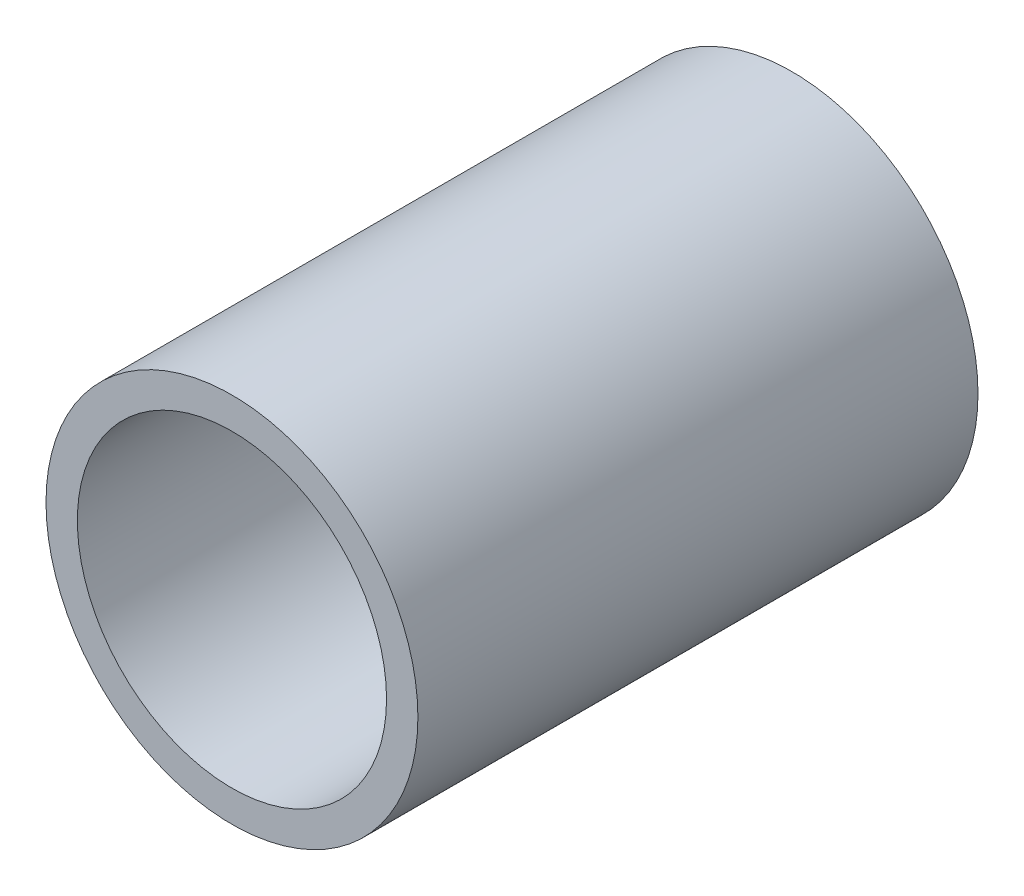
ISO-10303-21;
HEADER;
FILE_DESCRIPTION(('STEP AP214'),'2;1');
FILE_NAME('part.step','',(''),(''),'','','');
FILE_SCHEMA(('AUTOMOTIVE_DESIGN { 1 0 10303 214 1 1 1 1 }'));
ENDSEC;
DATA;
#1=APPLICATION_CONTEXT('core data for automotive mechanical design processes');
#2=APPLICATION_PROTOCOL_DEFINITION('international standard','automotive_design',2000,#1);
#3=PRODUCT_CONTEXT('',#1,'mechanical');
#4=PRODUCT('Part','Part','',(#3));
#5=PRODUCT_RELATED_PRODUCT_CATEGORY('part','',(#4));
#6=PRODUCT_DEFINITION_FORMATION('','',#4);
#7=PRODUCT_DEFINITION_CONTEXT('part definition',#1,'design');
#8=PRODUCT_DEFINITION('design','',#6,#7);
#9=PRODUCT_DEFINITION_SHAPE('','',#8);
#10=(LENGTH_UNIT() NAMED_UNIT(*) SI_UNIT(.MILLI.,.METRE.));
#11=(NAMED_UNIT(*) PLANE_ANGLE_UNIT() SI_UNIT($,.RADIAN.));
#12=(NAMED_UNIT(*) SI_UNIT($,.STERADIAN.) SOLID_ANGLE_UNIT());
#13=UNCERTAINTY_MEASURE_WITH_UNIT(LENGTH_MEASURE(1.E-05),#10,'distance_accuracy_value','');
#14=(GEOMETRIC_REPRESENTATION_CONTEXT(3) GLOBAL_UNCERTAINTY_ASSIGNED_CONTEXT((#13)) GLOBAL_UNIT_ASSIGNED_CONTEXT((#10,
#11,#12)) REPRESENTATION_CONTEXT('',''));
#15=CARTESIAN_POINT('',(0.,0.,0.));
#16=DIRECTION('',(0.,0.,1.));
#17=DIRECTION('',(1.,0.,0.));
#18=AXIS2_PLACEMENT_3D('',#15,#16,#17);
#19=CARTESIAN_POINT('',(574.675,28.5749999999999,63.5));
#20=DIRECTION('',(0.,0.,1.));
#21=DIRECTION('',(1.,0.,0.));
#22=AXIS2_PLACEMENT_3D('',#19,#20,#21);
#23=CYLINDRICAL_SURFACE('',#22,17.526);
#24=CARTESIAN_POINT('',(574.675,28.575,0.));
#25=DIRECTION('',(0.,0.,1.));
#26=DIRECTION('',(1.,0.,0.));
#27=AXIS2_PLACEMENT_3D('',#24,#25,#26);
#28=CIRCLE('',#27,17.526);
#29=CARTESIAN_POINT('',(592.201,28.575,0.));
#30=VERTEX_POINT('',#29);
#31=EDGE_CURVE('E24',#30,#30,#28,.T.);
#32=ORIENTED_EDGE('',*,*,#31,.F.);
#33=EDGE_LOOP('',(#32));
#34=FACE_BOUND('',#33,.T.);
#35=CARTESIAN_POINT('',(574.675,28.5749999999999,63.5));
#36=DIRECTION('',(0.,0.,1.));
#37=DIRECTION('',(1.,0.,0.));
#38=AXIS2_PLACEMENT_3D('',#35,#36,#37);
#39=CIRCLE('',#38,17.526);
#40=CARTESIAN_POINT('',(592.201,28.5749999999999,63.5));
#41=VERTEX_POINT('',#40);
#42=EDGE_CURVE('E15',#41,#41,#39,.T.);
#43=ORIENTED_EDGE('',*,*,#42,.T.);
#44=EDGE_LOOP('',(#43));
#45=FACE_BOUND('',#44,.T.);
#46=ADVANCED_FACE('F12',(#34,#45),#23,.F.);
#47=CARTESIAN_POINT('',(39.116,38.0999999999999,63.5));
#48=DIRECTION('',(0.,0.,-1.));
#49=DIRECTION('',(-1.,0.,0.));
#50=AXIS2_PLACEMENT_3D('',#47,#48,#49);
#51=PLANE('',#50);
#52=CARTESIAN_POINT('',(574.675,28.5749999999999,63.5));
#53=DIRECTION('',(0.,0.,1.));
#54=DIRECTION('',(1.,0.,0.));
#55=AXIS2_PLACEMENT_3D('',#52,#53,#54);
#56=CIRCLE('',#55,21.082);
#57=CARTESIAN_POINT('',(595.757,28.5749999999999,63.5));
#58=VERTEX_POINT('',#57);
#59=EDGE_CURVE('E19',#58,#58,#56,.F.);
#60=ORIENTED_EDGE('',*,*,#59,.F.);
#61=EDGE_LOOP('',(#60));
#62=FACE_BOUND('',#61,.T.);
#63=ORIENTED_EDGE('',*,*,#42,.F.);
#64=EDGE_LOOP('',(#63));
#65=FACE_BOUND('',#64,.T.);
#66=ADVANCED_FACE('F33',(#62,#65),#51,.F.);
#67=CARTESIAN_POINT('',(39.116,38.1,0.));
#68=DIRECTION('',(0.,0.,-1.));
#69=DIRECTION('',(-1.,0.,0.));
#70=AXIS2_PLACEMENT_3D('',#67,#68,#69);
#71=PLANE('',#70);
#72=CARTESIAN_POINT('',(574.675,28.575,0.));
#73=DIRECTION('',(0.,0.,1.));
#74=DIRECTION('',(1.,0.,0.));
#75=AXIS2_PLACEMENT_3D('',#72,#73,#74);
#76=CIRCLE('',#75,21.082);
#77=CARTESIAN_POINT('',(595.757,28.575,0.));
#78=VERTEX_POINT('',#77);
#79=EDGE_CURVE('E8',#78,#78,#76,.T.);
#80=ORIENTED_EDGE('',*,*,#79,.F.);
#81=EDGE_LOOP('',(#80));
#82=FACE_BOUND('',#81,.T.);
#83=ORIENTED_EDGE('',*,*,#31,.T.);
#84=EDGE_LOOP('',(#83));
#85=FACE_BOUND('',#84,.T.);
#86=ADVANCED_FACE('F35',(#82,#85),#71,.T.);
#87=CARTESIAN_POINT('',(574.675,28.5749999999999,63.5));
#88=DIRECTION('',(0.,0.,1.));
#89=DIRECTION('',(1.,0.,0.));
#90=AXIS2_PLACEMENT_3D('',#87,#88,#89);
#91=CYLINDRICAL_SURFACE('',#90,21.082);
#92=ORIENTED_EDGE('',*,*,#79,.T.);
#93=EDGE_LOOP('',(#92));
#94=FACE_BOUND('',#93,.T.);
#95=ORIENTED_EDGE('',*,*,#59,.T.);
#96=EDGE_LOOP('',(#95));
#97=FACE_BOUND('',#96,.T.);
#98=ADVANCED_FACE('F42',(#94,#97),#91,.T.);
#99=CLOSED_SHELL('',(#46,#66,#86,#98));
#100=MANIFOLD_SOLID_BREP('B1',#99);
#101=ADVANCED_BREP_SHAPE_REPRESENTATION('',(#18,#100),#14);
#102=SHAPE_DEFINITION_REPRESENTATION(#9,#101);
ENDSEC;
END-ISO-10303-21;
